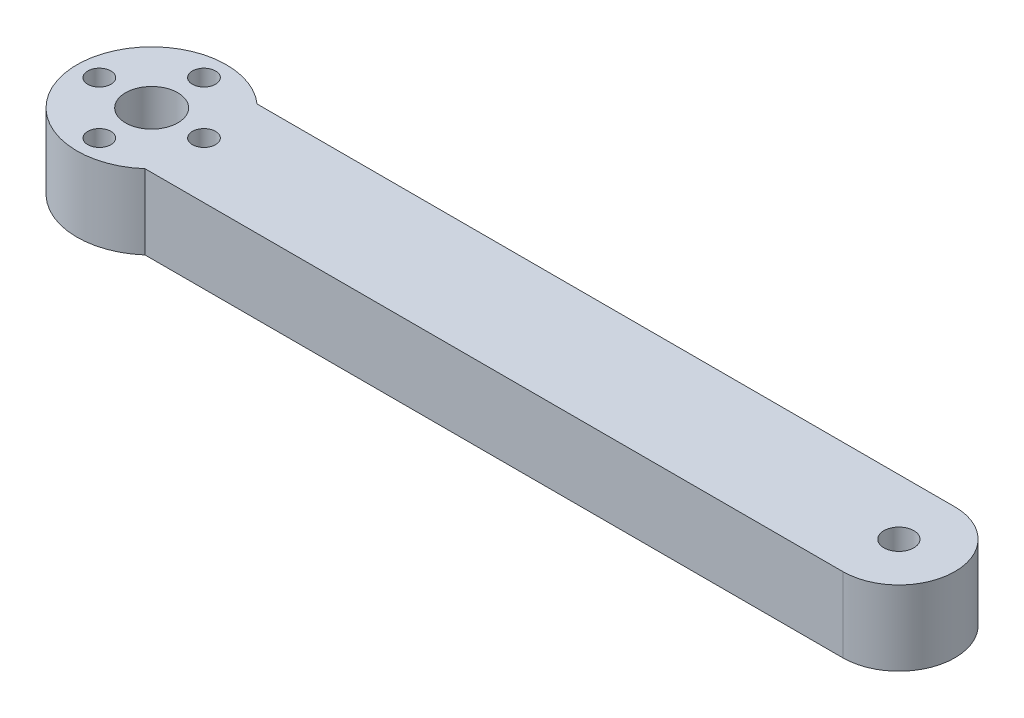
ISO-10303-21;
HEADER;
FILE_DESCRIPTION(('STEP AP214'),'2;1');
FILE_NAME('part.step','',(''),(''),'','','');
FILE_SCHEMA(('AUTOMOTIVE_DESIGN { 1 0 10303 214 1 1 1 1 }'));
ENDSEC;
DATA;
#1=APPLICATION_CONTEXT('core data for automotive mechanical design processes');
#2=APPLICATION_PROTOCOL_DEFINITION('international standard','automotive_design',2000,#1);
#3=PRODUCT_CONTEXT('',#1,'mechanical');
#4=PRODUCT('Part','Part','',(#3));
#5=PRODUCT_RELATED_PRODUCT_CATEGORY('part','',(#4));
#6=PRODUCT_DEFINITION_FORMATION('','',#4);
#7=PRODUCT_DEFINITION_CONTEXT('part definition',#1,'design');
#8=PRODUCT_DEFINITION('design','',#6,#7);
#9=PRODUCT_DEFINITION_SHAPE('','',#8);
#10=(LENGTH_UNIT() NAMED_UNIT(*) SI_UNIT(.MILLI.,.METRE.));
#11=(NAMED_UNIT(*) PLANE_ANGLE_UNIT() SI_UNIT($,.RADIAN.));
#12=(NAMED_UNIT(*) SI_UNIT($,.STERADIAN.) SOLID_ANGLE_UNIT());
#13=UNCERTAINTY_MEASURE_WITH_UNIT(LENGTH_MEASURE(1.E-05),#10,'distance_accuracy_value','');
#14=(GEOMETRIC_REPRESENTATION_CONTEXT(3) GLOBAL_UNCERTAINTY_ASSIGNED_CONTEXT((#13)) GLOBAL_UNIT_ASSIGNED_CONTEXT((#10,
#11,#12)) REPRESENTATION_CONTEXT('',''));
#15=CARTESIAN_POINT('',(0.,0.,0.));
#16=DIRECTION('',(0.,0.,1.));
#17=DIRECTION('',(1.,0.,0.));
#18=AXIS2_PLACEMENT_3D('',#15,#16,#17);
#19=CARTESIAN_POINT('',(0.,10.,0.));
#20=DIRECTION('',(0.,1.,0.));
#21=DIRECTION('',(0.,0.,1.));
#22=AXIS2_PLACEMENT_3D('',#19,#20,#21);
#23=PLANE('',#22);
#24=CARTESIAN_POINT('',(0.,10.,-7.));
#25=DIRECTION('',(0.,1.,0.));
#26=DIRECTION('',(0.,0.,1.));
#27=AXIS2_PLACEMENT_3D('',#24,#25,#26);
#28=CIRCLE('',#27,1.55);
#29=CARTESIAN_POINT('',(0.,10.,-5.45));
#30=VERTEX_POINT('',#29);
#31=EDGE_CURVE('E178',#30,#30,#28,.T.);
#32=ORIENTED_EDGE('',*,*,#31,.F.);
#33=EDGE_LOOP('',(#32));
#34=FACE_BOUND('',#33,.T.);
#35=CARTESIAN_POINT('',(0.,10.,0.));
#36=DIRECTION('',(0.,1.,0.));
#37=DIRECTION('',(0.,0.,1.));
#38=AXIS2_PLACEMENT_3D('',#35,#36,#37);
#39=CIRCLE('',#38,3.5);
#40=CARTESIAN_POINT('',(0.,10.,3.5));
#41=VERTEX_POINT('',#40);
#42=EDGE_CURVE('E202',#41,#41,#39,.T.);
#43=ORIENTED_EDGE('',*,*,#42,.F.);
#44=EDGE_LOOP('',(#43));
#45=FACE_BOUND('',#44,.T.);
#46=CARTESIAN_POINT('',(-7.,10.,0.));
#47=DIRECTION('',(0.,1.,0.));
#48=DIRECTION('',(0.,0.,1.));
#49=AXIS2_PLACEMENT_3D('',#46,#47,#48);
#50=CIRCLE('',#49,1.55);
#51=CARTESIAN_POINT('',(-7.,10.,1.55));
#52=VERTEX_POINT('',#51);
#53=EDGE_CURVE('E194',#52,#52,#50,.T.);
#54=ORIENTED_EDGE('',*,*,#53,.F.);
#55=EDGE_LOOP('',(#54));
#56=FACE_BOUND('',#55,.T.);
#57=CARTESIAN_POINT('',(0.,10.,7.));
#58=DIRECTION('',(0.,1.,0.));
#59=DIRECTION('',(0.,0.,1.));
#60=AXIS2_PLACEMENT_3D('',#57,#58,#59);
#61=CIRCLE('',#60,1.55);
#62=CARTESIAN_POINT('',(0.,10.,8.55));
#63=VERTEX_POINT('',#62);
#64=EDGE_CURVE('E193',#63,#63,#61,.T.);
#65=ORIENTED_EDGE('',*,*,#64,.F.);
#66=EDGE_LOOP('',(#65));
#67=FACE_BOUND('',#66,.T.);
#68=CARTESIAN_POINT('',(7.,10.,0.));
#69=DIRECTION('',(0.,1.,0.));
#70=DIRECTION('',(0.,0.,1.));
#71=AXIS2_PLACEMENT_3D('',#68,#69,#70);
#72=CIRCLE('',#71,1.55);
#73=CARTESIAN_POINT('',(7.,10.,1.55));
#74=VERTEX_POINT('',#73);
#75=EDGE_CURVE('E186',#74,#74,#72,.T.);
#76=ORIENTED_EDGE('',*,*,#75,.F.);
#77=EDGE_LOOP('',(#76));
#78=FACE_BOUND('',#77,.T.);
#79=DIRECTION('',(-1.,0.,0.));
#80=VECTOR('',#79,1.);
#81=CARTESIAN_POINT('',(0.,10.,-7.5));
#82=LINE('',#81,#80);
#83=CARTESIAN_POINT('',(100.,10.,-7.5));
#84=VERTEX_POINT('',#83);
#85=CARTESIAN_POINT('',(6.61437827766148,10.,-7.5));
#86=VERTEX_POINT('',#85);
#87=EDGE_CURVE('E95',#84,#86,#82,.T.);
#88=ORIENTED_EDGE('',*,*,#87,.T.);
#89=CARTESIAN_POINT('',(0.,10.,0.));
#90=DIRECTION('',(0.,1.,0.));
#91=DIRECTION('',(0.,0.,1.));
#92=AXIS2_PLACEMENT_3D('',#89,#90,#91);
#93=CIRCLE('',#92,10.);
#94=CARTESIAN_POINT('',(6.61437827766148,10.,7.5));
#95=VERTEX_POINT('',#94);
#96=EDGE_CURVE('E86',#86,#95,#93,.T.);
#97=ORIENTED_EDGE('',*,*,#96,.T.);
#98=DIRECTION('',(1.,0.,0.));
#99=VECTOR('',#98,1.);
#100=CARTESIAN_POINT('',(0.,10.,7.5));
#101=LINE('',#100,#99);
#102=CARTESIAN_POINT('',(100.,10.,7.5));
#103=VERTEX_POINT('',#102);
#104=EDGE_CURVE('E93',#95,#103,#101,.T.);
#105=ORIENTED_EDGE('',*,*,#104,.T.);
#106=CARTESIAN_POINT('',(100.,10.,0.));
#107=DIRECTION('',(0.,1.,0.));
#108=DIRECTION('',(0.,0.,1.));
#109=AXIS2_PLACEMENT_3D('',#106,#107,#108);
#110=CIRCLE('',#109,7.5);
#111=EDGE_CURVE('E57',#103,#84,#110,.T.);
#112=ORIENTED_EDGE('',*,*,#111,.T.);
#113=EDGE_LOOP('',(#88,#97,#105,#112));
#114=FACE_BOUND('',#113,.T.);
#115=CARTESIAN_POINT('',(100.,10.,0.));
#116=DIRECTION('',(0.,1.,0.));
#117=DIRECTION('',(0.,0.,1.));
#118=AXIS2_PLACEMENT_3D('',#115,#116,#117);
#119=CIRCLE('',#118,2.);
#120=CARTESIAN_POINT('',(100.,10.,2.));
#121=VERTEX_POINT('',#120);
#122=EDGE_CURVE('E116',#121,#121,#119,.T.);
#123=ORIENTED_EDGE('',*,*,#122,.F.);
#124=EDGE_LOOP('',(#123));
#125=FACE_BOUND('',#124,.T.);
#126=ADVANCED_FACE('F39',(#34,#45,#56,#67,#78,#114,#125),#23,.T.);
#127=CARTESIAN_POINT('',(0.,0.,0.));
#128=DIRECTION('',(0.,1.,0.));
#129=DIRECTION('',(0.,0.,1.));
#130=AXIS2_PLACEMENT_3D('',#127,#128,#129);
#131=PLANE('',#130);
#132=CARTESIAN_POINT('',(0.,0.,-7.));
#133=DIRECTION('',(0.,1.,0.));
#134=DIRECTION('',(0.,0.,1.));
#135=AXIS2_PLACEMENT_3D('',#132,#133,#134);
#136=CIRCLE('',#135,1.55);
#137=CARTESIAN_POINT('',(0.,0.,-5.45));
#138=VERTEX_POINT('',#137);
#139=EDGE_CURVE('E97',#138,#138,#136,.T.);
#140=ORIENTED_EDGE('',*,*,#139,.T.);
#141=EDGE_LOOP('',(#140));
#142=FACE_BOUND('',#141,.T.);
#143=CARTESIAN_POINT('',(0.,0.,0.));
#144=DIRECTION('',(0.,1.,0.));
#145=DIRECTION('',(0.,0.,1.));
#146=AXIS2_PLACEMENT_3D('',#143,#144,#145);
#147=CIRCLE('',#146,3.5);
#148=CARTESIAN_POINT('',(0.,0.,3.5));
#149=VERTEX_POINT('',#148);
#150=EDGE_CURVE('E198',#149,#149,#147,.T.);
#151=ORIENTED_EDGE('',*,*,#150,.T.);
#152=EDGE_LOOP('',(#151));
#153=FACE_BOUND('',#152,.T.);
#154=CARTESIAN_POINT('',(-7.,0.,0.));
#155=DIRECTION('',(0.,1.,0.));
#156=DIRECTION('',(0.,0.,1.));
#157=AXIS2_PLACEMENT_3D('',#154,#155,#156);
#158=CIRCLE('',#157,1.55);
#159=CARTESIAN_POINT('',(-7.,0.,1.55));
#160=VERTEX_POINT('',#159);
#161=EDGE_CURVE('E189',#160,#160,#158,.T.);
#162=ORIENTED_EDGE('',*,*,#161,.T.);
#163=EDGE_LOOP('',(#162));
#164=FACE_BOUND('',#163,.T.);
#165=CARTESIAN_POINT('',(0.,0.,7.));
#166=DIRECTION('',(0.,1.,0.));
#167=DIRECTION('',(0.,0.,1.));
#168=AXIS2_PLACEMENT_3D('',#165,#166,#167);
#169=CIRCLE('',#168,1.55);
#170=CARTESIAN_POINT('',(0.,0.,8.55));
#171=VERTEX_POINT('',#170);
#172=EDGE_CURVE('E209',#171,#171,#169,.T.);
#173=ORIENTED_EDGE('',*,*,#172,.T.);
#174=EDGE_LOOP('',(#173));
#175=FACE_BOUND('',#174,.T.);
#176=CARTESIAN_POINT('',(7.,0.,0.));
#177=DIRECTION('',(0.,1.,0.));
#178=DIRECTION('',(0.,0.,1.));
#179=AXIS2_PLACEMENT_3D('',#176,#177,#178);
#180=CIRCLE('',#179,1.55);
#181=CARTESIAN_POINT('',(7.,0.,1.55));
#182=VERTEX_POINT('',#181);
#183=EDGE_CURVE('E180',#182,#182,#180,.T.);
#184=ORIENTED_EDGE('',*,*,#183,.T.);
#185=EDGE_LOOP('',(#184));
#186=FACE_BOUND('',#185,.T.);
#187=DIRECTION('',(1.,0.,0.));
#188=VECTOR('',#187,1.);
#189=CARTESIAN_POINT('',(0.,0.,7.5));
#190=LINE('',#189,#188);
#191=CARTESIAN_POINT('',(6.61437827766148,0.,7.5));
#192=VERTEX_POINT('',#191);
#193=CARTESIAN_POINT('',(100.,0.,7.5));
#194=VERTEX_POINT('',#193);
#195=EDGE_CURVE('E68',#192,#194,#190,.T.);
#196=ORIENTED_EDGE('',*,*,#195,.F.);
#197=CARTESIAN_POINT('',(0.,0.,0.));
#198=DIRECTION('',(0.,1.,0.));
#199=DIRECTION('',(0.,0.,1.));
#200=AXIS2_PLACEMENT_3D('',#197,#198,#199);
#201=CIRCLE('',#200,10.);
#202=CARTESIAN_POINT('',(6.61437827766148,0.,-7.5));
#203=VERTEX_POINT('',#202);
#204=EDGE_CURVE('E87',#203,#192,#201,.T.);
#205=ORIENTED_EDGE('',*,*,#204,.F.);
#206=DIRECTION('',(-1.,0.,0.));
#207=VECTOR('',#206,1.);
#208=CARTESIAN_POINT('',(0.,0.,-7.5));
#209=LINE('',#208,#207);
#210=CARTESIAN_POINT('',(100.,0.,-7.5));
#211=VERTEX_POINT('',#210);
#212=EDGE_CURVE('E100',#211,#203,#209,.T.);
#213=ORIENTED_EDGE('',*,*,#212,.F.);
#214=CARTESIAN_POINT('',(100.,0.,0.));
#215=DIRECTION('',(0.,1.,0.));
#216=DIRECTION('',(0.,0.,1.));
#217=AXIS2_PLACEMENT_3D('',#214,#215,#216);
#218=CIRCLE('',#217,7.5);
#219=EDGE_CURVE('E106',#194,#211,#218,.T.);
#220=ORIENTED_EDGE('',*,*,#219,.F.);
#221=EDGE_LOOP('',(#196,#205,#213,#220));
#222=FACE_BOUND('',#221,.T.);
#223=CARTESIAN_POINT('',(100.,0.,0.));
#224=DIRECTION('',(0.,1.,0.));
#225=DIRECTION('',(0.,0.,1.));
#226=AXIS2_PLACEMENT_3D('',#223,#224,#225);
#227=CIRCLE('',#226,2.);
#228=CARTESIAN_POINT('',(100.,0.,2.));
#229=VERTEX_POINT('',#228);
#230=EDGE_CURVE('E90',#229,#229,#227,.T.);
#231=ORIENTED_EDGE('',*,*,#230,.T.);
#232=EDGE_LOOP('',(#231));
#233=FACE_BOUND('',#232,.T.);
#234=ADVANCED_FACE('F127',(#142,#153,#164,#175,#186,#222,#233),#131,.F.);
#235=CARTESIAN_POINT('',(0.,10.,7.5));
#236=DIRECTION('',(0.,0.,-1.));
#237=DIRECTION('',(-1.,0.,0.));
#238=AXIS2_PLACEMENT_3D('',#235,#236,#237);
#239=PLANE('',#238);
#240=ORIENTED_EDGE('',*,*,#104,.F.);
#241=DIRECTION('',(0.,1.,0.));
#242=VECTOR('',#241,1.);
#243=CARTESIAN_POINT('',(6.61437827766148,0.,7.5));
#244=LINE('',#243,#242);
#245=EDGE_CURVE('E83',#95,#192,#244,.F.);
#246=ORIENTED_EDGE('',*,*,#245,.T.);
#247=ORIENTED_EDGE('',*,*,#195,.T.);
#248=DIRECTION('',(0.,-1.,0.));
#249=VECTOR('',#248,1.);
#250=CARTESIAN_POINT('',(100.,10.,7.5));
#251=LINE('',#250,#249);
#252=EDGE_CURVE('E49',#103,#194,#251,.T.);
#253=ORIENTED_EDGE('',*,*,#252,.F.);
#254=EDGE_LOOP('',(#240,#246,#247,#253));
#255=FACE_BOUND('',#254,.T.);
#256=ADVANCED_FACE('F41',(#255),#239,.F.);
#257=CARTESIAN_POINT('',(100.,10.,0.));
#258=DIRECTION('',(0.,-1.,0.));
#259=DIRECTION('',(0.,0.,-1.));
#260=AXIS2_PLACEMENT_3D('',#257,#258,#259);
#261=CYLINDRICAL_SURFACE('',#260,7.5);
#262=ORIENTED_EDGE('',*,*,#219,.T.);
#263=DIRECTION('',(0.,-1.,0.));
#264=VECTOR('',#263,1.);
#265=CARTESIAN_POINT('',(100.,10.,-7.5));
#266=LINE('',#265,#264);
#267=EDGE_CURVE('E113',#84,#211,#266,.T.);
#268=ORIENTED_EDGE('',*,*,#267,.F.);
#269=ORIENTED_EDGE('',*,*,#111,.F.);
#270=ORIENTED_EDGE('',*,*,#252,.T.);
#271=EDGE_LOOP('',(#262,#268,#269,#270));
#272=FACE_BOUND('',#271,.T.);
#273=ADVANCED_FACE('F124',(#272),#261,.T.);
#274=CARTESIAN_POINT('',(0.,10.,-7.5));
#275=DIRECTION('',(0.,0.,1.));
#276=DIRECTION('',(1.,0.,0.));
#277=AXIS2_PLACEMENT_3D('',#274,#275,#276);
#278=PLANE('',#277);
#279=ORIENTED_EDGE('',*,*,#212,.T.);
#280=DIRECTION('',(0.,1.,0.));
#281=VECTOR('',#280,1.);
#282=CARTESIAN_POINT('',(6.61437827766148,0.,-7.5));
#283=LINE('',#282,#281);
#284=EDGE_CURVE('E11',#203,#86,#283,.T.);
#285=ORIENTED_EDGE('',*,*,#284,.T.);
#286=ORIENTED_EDGE('',*,*,#87,.F.);
#287=ORIENTED_EDGE('',*,*,#267,.T.);
#288=EDGE_LOOP('',(#279,#285,#286,#287));
#289=FACE_BOUND('',#288,.T.);
#290=ADVANCED_FACE('F130',(#289),#278,.F.);
#291=CARTESIAN_POINT('',(100.,10.,0.));
#292=DIRECTION('',(0.,-1.,0.));
#293=DIRECTION('',(0.,0.,-1.));
#294=AXIS2_PLACEMENT_3D('',#291,#292,#293);
#295=CYLINDRICAL_SURFACE('',#294,2.);
#296=ORIENTED_EDGE('',*,*,#122,.T.);
#297=EDGE_LOOP('',(#296));
#298=FACE_BOUND('',#297,.T.);
#299=ORIENTED_EDGE('',*,*,#230,.F.);
#300=EDGE_LOOP('',(#299));
#301=FACE_BOUND('',#300,.T.);
#302=ADVANCED_FACE('F132',(#298,#301),#295,.F.);
#303=CARTESIAN_POINT('',(0.,0.,0.));
#304=DIRECTION('',(0.,1.,0.));
#305=DIRECTION('',(0.,0.,1.));
#306=AXIS2_PLACEMENT_3D('',#303,#304,#305);
#307=CYLINDRICAL_SURFACE('',#306,10.);
#308=ORIENTED_EDGE('',*,*,#245,.F.);
#309=ORIENTED_EDGE('',*,*,#96,.F.);
#310=ORIENTED_EDGE('',*,*,#284,.F.);
#311=ORIENTED_EDGE('',*,*,#204,.T.);
#312=EDGE_LOOP('',(#308,#309,#310,#311));
#313=FACE_BOUND('',#312,.T.);
#314=ADVANCED_FACE('F85',(#313),#307,.T.);
#315=CARTESIAN_POINT('',(7.,0.,0.));
#316=DIRECTION('',(0.,1.,0.));
#317=DIRECTION('',(0.,0.,1.));
#318=AXIS2_PLACEMENT_3D('',#315,#316,#317);
#319=CYLINDRICAL_SURFACE('',#318,1.55);
#320=ORIENTED_EDGE('',*,*,#183,.F.);
#321=EDGE_LOOP('',(#320));
#322=FACE_BOUND('',#321,.T.);
#323=ORIENTED_EDGE('',*,*,#75,.T.);
#324=EDGE_LOOP('',(#323));
#325=FACE_BOUND('',#324,.T.);
#326=ADVANCED_FACE('F153',(#322,#325),#319,.F.);
#327=CARTESIAN_POINT('',(0.,0.,7.));
#328=DIRECTION('',(0.,1.,0.));
#329=DIRECTION('',(0.,0.,1.));
#330=AXIS2_PLACEMENT_3D('',#327,#328,#329);
#331=CYLINDRICAL_SURFACE('',#330,1.55);
#332=ORIENTED_EDGE('',*,*,#172,.F.);
#333=EDGE_LOOP('',(#332));
#334=FACE_BOUND('',#333,.T.);
#335=ORIENTED_EDGE('',*,*,#64,.T.);
#336=EDGE_LOOP('',(#335));
#337=FACE_BOUND('',#336,.T.);
#338=ADVANCED_FACE('F154',(#334,#337),#331,.F.);
#339=CARTESIAN_POINT('',(-7.,0.,0.));
#340=DIRECTION('',(0.,1.,0.));
#341=DIRECTION('',(0.,0.,1.));
#342=AXIS2_PLACEMENT_3D('',#339,#340,#341);
#343=CYLINDRICAL_SURFACE('',#342,1.55);
#344=ORIENTED_EDGE('',*,*,#161,.F.);
#345=EDGE_LOOP('',(#344));
#346=FACE_BOUND('',#345,.T.);
#347=ORIENTED_EDGE('',*,*,#53,.T.);
#348=EDGE_LOOP('',(#347));
#349=FACE_BOUND('',#348,.T.);
#350=ADVANCED_FACE('F157',(#346,#349),#343,.F.);
#351=CARTESIAN_POINT('',(0.,0.,0.));
#352=DIRECTION('',(0.,1.,0.));
#353=DIRECTION('',(0.,0.,1.));
#354=AXIS2_PLACEMENT_3D('',#351,#352,#353);
#355=CYLINDRICAL_SURFACE('',#354,3.5);
#356=ORIENTED_EDGE('',*,*,#150,.F.);
#357=EDGE_LOOP('',(#356));
#358=FACE_BOUND('',#357,.T.);
#359=ORIENTED_EDGE('',*,*,#42,.T.);
#360=EDGE_LOOP('',(#359));
#361=FACE_BOUND('',#360,.T.);
#362=ADVANCED_FACE('F162',(#358,#361),#355,.F.);
#363=CARTESIAN_POINT('',(0.,0.,-7.));
#364=DIRECTION('',(0.,1.,0.));
#365=DIRECTION('',(0.,0.,1.));
#366=AXIS2_PLACEMENT_3D('',#363,#364,#365);
#367=CYLINDRICAL_SURFACE('',#366,1.55);
#368=ORIENTED_EDGE('',*,*,#139,.F.);
#369=EDGE_LOOP('',(#368));
#370=FACE_BOUND('',#369,.T.);
#371=ORIENTED_EDGE('',*,*,#31,.T.);
#372=EDGE_LOOP('',(#371));
#373=FACE_BOUND('',#372,.T.);
#374=ADVANCED_FACE('F165',(#370,#373),#367,.F.);
#375=CLOSED_SHELL('',(#126,#234,#256,#273,#290,#302,#314,#326,#338,#350,#362,#374));
#376=MANIFOLD_SOLID_BREP('B2',#375);
#377=ADVANCED_BREP_SHAPE_REPRESENTATION('',(#18,#376),#14);
#378=SHAPE_DEFINITION_REPRESENTATION(#9,#377);
ENDSEC;
END-ISO-10303-21;
